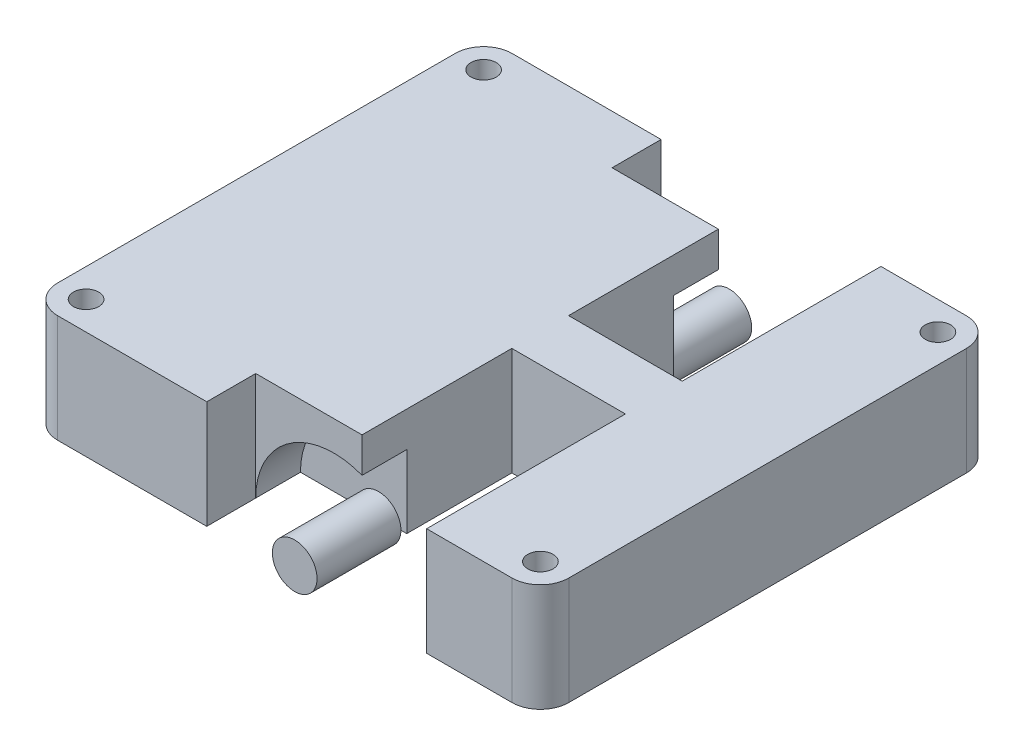
ISO-10303-21;
HEADER;
FILE_DESCRIPTION(('STEP AP214'),'2;1');
FILE_NAME('part.step','',(''),(''),'','','');
FILE_SCHEMA(('AUTOMOTIVE_DESIGN { 1 0 10303 214 1 1 1 1 }'));
ENDSEC;
DATA;
#1=APPLICATION_CONTEXT('core data for automotive mechanical design processes');
#2=APPLICATION_PROTOCOL_DEFINITION('international standard','automotive_design',2000,#1);
#3=PRODUCT_CONTEXT('',#1,'mechanical');
#4=PRODUCT('Part','Part','',(#3));
#5=PRODUCT_RELATED_PRODUCT_CATEGORY('part','',(#4));
#6=PRODUCT_DEFINITION_FORMATION('','',#4);
#7=PRODUCT_DEFINITION_CONTEXT('part definition',#1,'design');
#8=PRODUCT_DEFINITION('design','',#6,#7);
#9=PRODUCT_DEFINITION_SHAPE('','',#8);
#10=(LENGTH_UNIT() NAMED_UNIT(*) SI_UNIT(.MILLI.,.METRE.));
#11=(NAMED_UNIT(*) PLANE_ANGLE_UNIT() SI_UNIT($,.RADIAN.));
#12=(NAMED_UNIT(*) SI_UNIT($,.STERADIAN.) SOLID_ANGLE_UNIT());
#13=UNCERTAINTY_MEASURE_WITH_UNIT(LENGTH_MEASURE(1.E-05),#10,'distance_accuracy_value','');
#14=(GEOMETRIC_REPRESENTATION_CONTEXT(3) GLOBAL_UNCERTAINTY_ASSIGNED_CONTEXT((#13)) GLOBAL_UNIT_ASSIGNED_CONTEXT((#10,
#11,#12)) REPRESENTATION_CONTEXT('',''));
#15=CARTESIAN_POINT('',(0.,0.,0.));
#16=DIRECTION('',(0.,0.,1.));
#17=DIRECTION('',(1.,0.,0.));
#18=AXIS2_PLACEMENT_3D('',#15,#16,#17);
#19=CARTESIAN_POINT('',(0.,0.,11.938));
#20=DIRECTION('',(0.,0.,1.));
#21=DIRECTION('',(-1.,0.,0.));
#22=AXIS2_PLACEMENT_3D('',#19,#20,#21);
#23=PLANE('',#22);
#24=DIRECTION('',(0.,1.,0.));
#25=VECTOR('',#24,1.);
#26=CARTESIAN_POINT('',(2.52328876210815,0.,11.938));
#27=LINE('',#26,#25);
#28=CARTESIAN_POINT('',(2.52328876210815,-4.826,11.938));
#29=VERTEX_POINT('',#28);
#30=CARTESIAN_POINT('',(2.52328876210815,1.68731243093856,11.938));
#31=VERTEX_POINT('',#30);
#32=EDGE_CURVE('E11',#29,#31,#27,.T.);
#33=ORIENTED_EDGE('',*,*,#32,.T.);
#34=CARTESIAN_POINT('',(0.,-4.826,11.938));
#35=DIRECTION('',(0.,0.,-1.));
#36=DIRECTION('',(-1.,0.,0.));
#37=AXIS2_PLACEMENT_3D('',#34,#35,#36);
#38=CIRCLE('',#37,6.985);
#39=CARTESIAN_POINT('',(-6.985,-4.826,11.938));
#40=VERTEX_POINT('',#39);
#41=EDGE_CURVE('E219',#40,#31,#38,.T.);
#42=ORIENTED_EDGE('',*,*,#41,.F.);
#43=DIRECTION('',(-1.,0.,0.));
#44=VECTOR('',#43,1.);
#45=CARTESIAN_POINT('',(6.985,-4.826,11.938));
#46=LINE('',#45,#44);
#47=CARTESIAN_POINT('',(-2.,-4.826,11.938));
#48=VERTEX_POINT('',#47);
#49=EDGE_CURVE('E286',#48,#40,#46,.T.);
#50=ORIENTED_EDGE('',*,*,#49,.F.);
#51=CARTESIAN_POINT('',(0.,-4.826,11.938));
#52=DIRECTION('',(0.,0.,-1.));
#53=DIRECTION('',(-1.,0.,0.));
#54=AXIS2_PLACEMENT_3D('',#51,#52,#53);
#55=CIRCLE('',#54,2.);
#56=CARTESIAN_POINT('',(2.,-4.826,11.938));
#57=VERTEX_POINT('',#56);
#58=EDGE_CURVE('E278',#48,#57,#55,.T.);
#59=ORIENTED_EDGE('',*,*,#58,.T.);
#60=EDGE_CURVE('E282',#29,#57,#46,.T.);
#61=ORIENTED_EDGE('',*,*,#60,.F.);
#62=EDGE_LOOP('',(#33,#42,#50,#59,#61));
#63=FACE_BOUND('',#62,.T.);
#64=ADVANCED_FACE('F43',(#63),#23,.T.);
#65=CARTESIAN_POINT('',(-22.86,4.826,20.32));
#66=DIRECTION('',(0.,0.,-1.));
#67=DIRECTION('',(-1.,0.,0.));
#68=AXIS2_PLACEMENT_3D('',#65,#66,#67);
#69=PLANE('',#68);
#70=DIRECTION('',(0.,-1.,0.));
#71=VECTOR('',#70,1.);
#72=CARTESIAN_POINT('',(12.6832887621081,4.826,20.32));
#73=LINE('',#72,#71);
#74=CARTESIAN_POINT('',(12.6832887621081,4.826,20.32));
#75=VERTEX_POINT('',#74);
#76=CARTESIAN_POINT('',(12.6832887621081,-4.826,20.32));
#77=VERTEX_POINT('',#76);
#78=EDGE_CURVE('E227',#75,#77,#73,.T.);
#79=ORIENTED_EDGE('',*,*,#78,.T.);
#80=DIRECTION('',(1.,0.,0.));
#81=VECTOR('',#80,1.);
#82=CARTESIAN_POINT('',(-22.86,-4.826,20.32));
#83=LINE('',#82,#81);
#84=CARTESIAN_POINT('',(20.32,-4.826,20.32));
#85=VERTEX_POINT('',#84);
#86=EDGE_CURVE('E438',#77,#85,#83,.T.);
#87=ORIENTED_EDGE('',*,*,#86,.T.);
#88=DIRECTION('',(0.,-1.,0.));
#89=VECTOR('',#88,1.);
#90=CARTESIAN_POINT('',(20.32,4.826,20.32));
#91=LINE('',#90,#89);
#92=CARTESIAN_POINT('',(20.32,4.826,20.32));
#93=VERTEX_POINT('',#92);
#94=EDGE_CURVE('E493',#85,#93,#91,.F.);
#95=ORIENTED_EDGE('',*,*,#94,.T.);
#96=DIRECTION('',(1.,0.,0.));
#97=VECTOR('',#96,1.);
#98=CARTESIAN_POINT('',(-22.86,4.826,20.32));
#99=LINE('',#98,#97);
#100=EDGE_CURVE('E420',#75,#93,#99,.T.);
#101=ORIENTED_EDGE('',*,*,#100,.F.);
#102=EDGE_LOOP('',(#79,#87,#95,#101));
#103=FACE_BOUND('',#102,.T.);
#104=ADVANCED_FACE('F598',(#103),#69,.F.);
#105=CARTESIAN_POINT('',(0.,4.826,0.));
#106=DIRECTION('',(0.,1.,0.));
#107=DIRECTION('',(0.,0.,1.));
#108=AXIS2_PLACEMENT_3D('',#105,#106,#107);
#109=PLANE('',#108);
#110=DIRECTION('',(1.,0.,0.));
#111=VECTOR('',#110,1.);
#112=CARTESIAN_POINT('',(0.,4.826,15.938));
#113=LINE('',#112,#111);
#114=CARTESIAN_POINT('',(-6.985,4.826,15.938));
#115=VERTEX_POINT('',#114);
#116=CARTESIAN_POINT('',(2.52328876210815,4.826,15.938));
#117=VERTEX_POINT('',#116);
#118=EDGE_CURVE('E233',#115,#117,#113,.T.);
#119=ORIENTED_EDGE('',*,*,#118,.T.);
#120=DIRECTION('',(0.,0.,1.));
#121=VECTOR('',#120,1.);
#122=CARTESIAN_POINT('',(2.52328876210815,4.826,2.54000000000001));
#123=LINE('',#122,#121);
#124=CARTESIAN_POINT('',(2.52328876210815,4.826,2.54000000000001));
#125=VERTEX_POINT('',#124);
#126=EDGE_CURVE('E231',#125,#117,#123,.T.);
#127=ORIENTED_EDGE('',*,*,#126,.F.);
#128=DIRECTION('',(1.,0.,0.));
#129=VECTOR('',#128,1.);
#130=CARTESIAN_POINT('',(2.52328876210815,4.826,2.54000000000001));
#131=LINE('',#130,#129);
#132=CARTESIAN_POINT('',(12.6832887621081,4.826,2.54000000000001));
#133=VERTEX_POINT('',#132);
#134=EDGE_CURVE('E242',#125,#133,#131,.T.);
#135=ORIENTED_EDGE('',*,*,#134,.T.);
#136=DIRECTION('',(0.,0.,1.));
#137=VECTOR('',#136,1.);
#138=CARTESIAN_POINT('',(12.6832887621081,4.826,2.54000000000001));
#139=LINE('',#138,#137);
#140=EDGE_CURVE('E259',#133,#75,#139,.T.);
#141=ORIENTED_EDGE('',*,*,#140,.T.);
#142=ORIENTED_EDGE('',*,*,#100,.T.);
#143=CARTESIAN_POINT('',(20.32,4.826,17.78));
#144=DIRECTION('',(0.,1.,0.));
#145=DIRECTION('',(0.,0.,1.));
#146=AXIS2_PLACEMENT_3D('',#143,#144,#145);
#147=CIRCLE('',#146,2.54);
#148=CARTESIAN_POINT('',(22.86,4.826,17.78));
#149=VERTEX_POINT('',#148);
#150=EDGE_CURVE('E473',#93,#149,#147,.T.);
#151=ORIENTED_EDGE('',*,*,#150,.T.);
#152=DIRECTION('',(0.,0.,-1.));
#153=VECTOR('',#152,1.);
#154=CARTESIAN_POINT('',(22.86,4.826,-20.32));
#155=LINE('',#154,#153);
#156=CARTESIAN_POINT('',(22.86,4.826,-17.78));
#157=VERTEX_POINT('',#156);
#158=EDGE_CURVE('E406',#149,#157,#155,.T.);
#159=ORIENTED_EDGE('',*,*,#158,.T.);
#160=CARTESIAN_POINT('',(20.32,4.826,-17.78));
#161=DIRECTION('',(0.,1.,0.));
#162=DIRECTION('',(0.,0.,1.));
#163=AXIS2_PLACEMENT_3D('',#160,#161,#162);
#164=CIRCLE('',#163,2.54);
#165=CARTESIAN_POINT('',(20.32,4.826,-20.32));
#166=VERTEX_POINT('',#165);
#167=EDGE_CURVE('E479',#157,#166,#164,.T.);
#168=ORIENTED_EDGE('',*,*,#167,.T.);
#169=DIRECTION('',(-1.,0.,0.));
#170=VECTOR('',#169,1.);
#171=CARTESIAN_POINT('',(-22.86,4.826,-20.32));
#172=LINE('',#171,#170);
#173=CARTESIAN_POINT('',(12.6832887621081,4.826,-20.32));
#174=VERTEX_POINT('',#173);
#175=EDGE_CURVE('E412',#166,#174,#172,.T.);
#176=ORIENTED_EDGE('',*,*,#175,.T.);
#177=DIRECTION('',(0.,0.,-1.));
#178=VECTOR('',#177,1.);
#179=CARTESIAN_POINT('',(12.6832887621081,4.826,-2.54000000000001));
#180=LINE('',#179,#178);
#181=CARTESIAN_POINT('',(12.6832887621081,4.826,-2.54000000000001));
#182=VERTEX_POINT('',#181);
#183=EDGE_CURVE('E333',#182,#174,#180,.T.);
#184=ORIENTED_EDGE('',*,*,#183,.F.);
#185=DIRECTION('',(1.,0.,0.));
#186=VECTOR('',#185,1.);
#187=CARTESIAN_POINT('',(2.52328876210815,4.826,-2.54000000000001));
#188=LINE('',#187,#186);
#189=CARTESIAN_POINT('',(2.52328876210815,4.826,-2.54000000000001));
#190=VERTEX_POINT('',#189);
#191=EDGE_CURVE('E318',#190,#182,#188,.T.);
#192=ORIENTED_EDGE('',*,*,#191,.F.);
#193=DIRECTION('',(0.,0.,-1.));
#194=VECTOR('',#193,1.);
#195=CARTESIAN_POINT('',(2.52328876210815,4.826,-2.54000000000001));
#196=LINE('',#195,#194);
#197=CARTESIAN_POINT('',(2.52328876210815,4.826,-15.938));
#198=VERTEX_POINT('',#197);
#199=EDGE_CURVE('E336',#190,#198,#196,.T.);
#200=ORIENTED_EDGE('',*,*,#199,.T.);
#201=DIRECTION('',(1.,0.,0.));
#202=VECTOR('',#201,1.);
#203=CARTESIAN_POINT('',(0.,4.826,-15.938));
#204=LINE('',#203,#202);
#205=CARTESIAN_POINT('',(-6.985,4.826,-15.938));
#206=VERTEX_POINT('',#205);
#207=EDGE_CURVE('E304',#206,#198,#204,.T.);
#208=ORIENTED_EDGE('',*,*,#207,.F.);
#209=DIRECTION('',(0.,0.,-1.));
#210=VECTOR('',#209,1.);
#211=CARTESIAN_POINT('',(-6.985,4.826,-11.938));
#212=LINE('',#211,#210);
#213=CARTESIAN_POINT('',(-6.985,4.826,-20.32));
#214=VERTEX_POINT('',#213);
#215=EDGE_CURVE('E361',#206,#214,#212,.T.);
#216=ORIENTED_EDGE('',*,*,#215,.T.);
#217=CARTESIAN_POINT('',(-20.32,4.826,-20.32));
#218=VERTEX_POINT('',#217);
#219=EDGE_CURVE('E410',#214,#218,#172,.T.);
#220=ORIENTED_EDGE('',*,*,#219,.T.);
#221=CARTESIAN_POINT('',(-20.32,4.826,-17.78));
#222=DIRECTION('',(0.,1.,0.));
#223=DIRECTION('',(0.,0.,1.));
#224=AXIS2_PLACEMENT_3D('',#221,#222,#223);
#225=CIRCLE('',#224,2.54);
#226=CARTESIAN_POINT('',(-22.86,4.826,-17.78));
#227=VERTEX_POINT('',#226);
#228=EDGE_CURVE('E476',#218,#227,#225,.T.);
#229=ORIENTED_EDGE('',*,*,#228,.T.);
#230=DIRECTION('',(0.,0.,1.));
#231=VECTOR('',#230,1.);
#232=CARTESIAN_POINT('',(-22.86,4.826,-20.32));
#233=LINE('',#232,#231);
#234=CARTESIAN_POINT('',(-22.86,4.826,17.78));
#235=VERTEX_POINT('',#234);
#236=EDGE_CURVE('E416',#227,#235,#233,.T.);
#237=ORIENTED_EDGE('',*,*,#236,.T.);
#238=CARTESIAN_POINT('',(-20.32,4.826,17.78));
#239=DIRECTION('',(0.,1.,0.));
#240=DIRECTION('',(0.,0.,1.));
#241=AXIS2_PLACEMENT_3D('',#238,#239,#240);
#242=CIRCLE('',#241,2.54);
#243=CARTESIAN_POINT('',(-20.32,4.826,20.32));
#244=VERTEX_POINT('',#243);
#245=EDGE_CURVE('E470',#235,#244,#242,.T.);
#246=ORIENTED_EDGE('',*,*,#245,.T.);
#247=CARTESIAN_POINT('',(-6.985,4.826,20.32));
#248=VERTEX_POINT('',#247);
#249=EDGE_CURVE('E421',#244,#248,#99,.T.);
#250=ORIENTED_EDGE('',*,*,#249,.T.);
#251=DIRECTION('',(0.,0.,1.));
#252=VECTOR('',#251,1.);
#253=CARTESIAN_POINT('',(-6.985,4.826,11.938));
#254=LINE('',#253,#252);
#255=EDGE_CURVE('E290',#115,#248,#254,.T.);
#256=ORIENTED_EDGE('',*,*,#255,.F.);
#257=EDGE_LOOP('',(#119,#127,#135,#141,#142,#151,#159,#168,#176,#184,#192,#200,#208,#216,#220,
#229,#237,#246,#250,#256));
#258=FACE_BOUND('',#257,.T.);
#259=CARTESIAN_POINT('',(20.32,4.826,-17.78));
#260=DIRECTION('',(0.,1.,0.));
#261=DIRECTION('',(0.,0.,1.));
#262=AXIS2_PLACEMENT_3D('',#259,#260,#261);
#263=CIRCLE('',#262,1.13029999999999);
#264=CARTESIAN_POINT('',(20.32,4.826,-16.6497));
#265=VERTEX_POINT('',#264);
#266=EDGE_CURVE('E370',#265,#265,#263,.T.);
#267=ORIENTED_EDGE('',*,*,#266,.F.);
#268=EDGE_LOOP('',(#267));
#269=FACE_BOUND('',#268,.T.);
#270=CARTESIAN_POINT('',(-20.32,4.826,17.78));
#271=DIRECTION('',(0.,1.,0.));
#272=DIRECTION('',(0.,0.,1.));
#273=AXIS2_PLACEMENT_3D('',#270,#271,#272);
#274=CIRCLE('',#273,1.13029999999999);
#275=CARTESIAN_POINT('',(-20.32,4.826,18.9103));
#276=VERTEX_POINT('',#275);
#277=EDGE_CURVE('E381',#276,#276,#274,.T.);
#278=ORIENTED_EDGE('',*,*,#277,.F.);
#279=EDGE_LOOP('',(#278));
#280=FACE_BOUND('',#279,.T.);
#281=CARTESIAN_POINT('',(-20.32,4.826,-17.78));
#282=DIRECTION('',(0.,1.,0.));
#283=DIRECTION('',(0.,0.,1.));
#284=AXIS2_PLACEMENT_3D('',#281,#282,#283);
#285=CIRCLE('',#284,1.13029999999999);
#286=CARTESIAN_POINT('',(-20.32,4.826,-16.6497));
#287=VERTEX_POINT('',#286);
#288=EDGE_CURVE('E389',#287,#287,#285,.T.);
#289=ORIENTED_EDGE('',*,*,#288,.F.);
#290=EDGE_LOOP('',(#289));
#291=FACE_BOUND('',#290,.T.);
#292=CARTESIAN_POINT('',(20.32,4.826,17.78));
#293=DIRECTION('',(0.,1.,0.));
#294=DIRECTION('',(0.,0.,1.));
#295=AXIS2_PLACEMENT_3D('',#292,#293,#294);
#296=CIRCLE('',#295,1.13029999999999);
#297=CARTESIAN_POINT('',(20.32,4.826,18.9103));
#298=VERTEX_POINT('',#297);
#299=EDGE_CURVE('E397',#298,#298,#296,.T.);
#300=ORIENTED_EDGE('',*,*,#299,.F.);
#301=EDGE_LOOP('',(#300));
#302=FACE_BOUND('',#301,.T.);
#303=ADVANCED_FACE('F537',(#258,#269,#280,#291,#302),#109,.T.);
#304=CARTESIAN_POINT('',(0.,-4.826,0.));
#305=DIRECTION('',(0.,1.,0.));
#306=DIRECTION('',(0.,0.,1.));
#307=AXIS2_PLACEMENT_3D('',#304,#305,#306);
#308=PLANE('',#307);
#309=CARTESIAN_POINT('',(20.32,-4.82599999999999,-17.78));
#310=DIRECTION('',(0.,1.,0.));
#311=DIRECTION('',(0.,0.,1.));
#312=AXIS2_PLACEMENT_3D('',#309,#310,#311);
#313=CIRCLE('',#312,1.13029999999999);
#314=CARTESIAN_POINT('',(20.32,-4.82599999999999,-16.6497));
#315=VERTEX_POINT('',#314);
#316=EDGE_CURVE('E377',#315,#315,#313,.T.);
#317=ORIENTED_EDGE('',*,*,#316,.T.);
#318=EDGE_LOOP('',(#317));
#319=FACE_BOUND('',#318,.T.);
#320=CARTESIAN_POINT('',(-20.32,-4.82599999999999,17.78));
#321=DIRECTION('',(0.,1.,0.));
#322=DIRECTION('',(0.,0.,1.));
#323=AXIS2_PLACEMENT_3D('',#320,#321,#322);
#324=CIRCLE('',#323,1.13029999999999);
#325=CARTESIAN_POINT('',(-20.32,-4.82599999999999,18.9103));
#326=VERTEX_POINT('',#325);
#327=EDGE_CURVE('E385',#326,#326,#324,.T.);
#328=ORIENTED_EDGE('',*,*,#327,.T.);
#329=EDGE_LOOP('',(#328));
#330=FACE_BOUND('',#329,.T.);
#331=CARTESIAN_POINT('',(-20.32,-4.82599999999999,-17.78));
#332=DIRECTION('',(0.,1.,0.));
#333=DIRECTION('',(0.,0.,1.));
#334=AXIS2_PLACEMENT_3D('',#331,#332,#333);
#335=CIRCLE('',#334,1.13029999999999);
#336=CARTESIAN_POINT('',(-20.32,-4.82599999999999,-16.6497));
#337=VERTEX_POINT('',#336);
#338=EDGE_CURVE('E393',#337,#337,#335,.T.);
#339=ORIENTED_EDGE('',*,*,#338,.T.);
#340=EDGE_LOOP('',(#339));
#341=FACE_BOUND('',#340,.T.);
#342=CARTESIAN_POINT('',(20.32,-4.82599999999999,17.78));
#343=DIRECTION('',(0.,1.,0.));
#344=DIRECTION('',(0.,0.,1.));
#345=AXIS2_PLACEMENT_3D('',#342,#343,#344);
#346=CIRCLE('',#345,1.13029999999999);
#347=CARTESIAN_POINT('',(20.32,-4.82599999999999,18.9103));
#348=VERTEX_POINT('',#347);
#349=EDGE_CURVE('E401',#348,#348,#346,.T.);
#350=ORIENTED_EDGE('',*,*,#349,.T.);
#351=EDGE_LOOP('',(#350));
#352=FACE_BOUND('',#351,.T.);
#353=DIRECTION('',(0.,0.,1.));
#354=VECTOR('',#353,1.);
#355=CARTESIAN_POINT('',(12.6832887621081,-4.826,2.54000000000001));
#356=LINE('',#355,#354);
#357=CARTESIAN_POINT('',(12.6832887621081,-4.826,2.54000000000001));
#358=VERTEX_POINT('',#357);
#359=EDGE_CURVE('E264',#358,#77,#356,.T.);
#360=ORIENTED_EDGE('',*,*,#359,.F.);
#361=DIRECTION('',(-1.,0.,0.));
#362=VECTOR('',#361,1.);
#363=CARTESIAN_POINT('',(12.6832887621081,-4.826,2.54000000000001));
#364=LINE('',#363,#362);
#365=CARTESIAN_POINT('',(2.52328876210815,-4.826,2.54000000000001));
#366=VERTEX_POINT('',#365);
#367=EDGE_CURVE('E249',#358,#366,#364,.T.);
#368=ORIENTED_EDGE('',*,*,#367,.T.);
#369=DIRECTION('',(0.,0.,1.));
#370=VECTOR('',#369,1.);
#371=CARTESIAN_POINT('',(2.52328876210815,-4.826,2.54000000000001));
#372=LINE('',#371,#370);
#373=EDGE_CURVE('E267',#366,#29,#372,.T.);
#374=ORIENTED_EDGE('',*,*,#373,.T.);
#375=ORIENTED_EDGE('',*,*,#60,.T.);
#376=EDGE_CURVE('E285',#57,#48,#46,.T.);
#377=ORIENTED_EDGE('',*,*,#376,.T.);
#378=ORIENTED_EDGE('',*,*,#49,.T.);
#379=DIRECTION('',(0.,0.,1.));
#380=VECTOR('',#379,1.);
#381=CARTESIAN_POINT('',(-6.985,-4.826,11.938));
#382=LINE('',#381,#380);
#383=CARTESIAN_POINT('',(-6.985,-4.826,15.938));
#384=VERTEX_POINT('',#383);
#385=EDGE_CURVE('E294',#40,#384,#382,.T.);
#386=ORIENTED_EDGE('',*,*,#385,.T.);
#387=CARTESIAN_POINT('',(-6.985,-4.826,20.32));
#388=VERTEX_POINT('',#387);
#389=EDGE_CURVE('E64',#384,#388,#382,.T.);
#390=ORIENTED_EDGE('',*,*,#389,.T.);
#391=CARTESIAN_POINT('',(-20.32,-4.826,20.32));
#392=VERTEX_POINT('',#391);
#393=EDGE_CURVE('E411',#392,#388,#83,.T.);
#394=ORIENTED_EDGE('',*,*,#393,.F.);
#395=CARTESIAN_POINT('',(-20.32,-4.826,17.78));
#396=DIRECTION('',(0.,1.,0.));
#397=DIRECTION('',(0.,0.,1.));
#398=AXIS2_PLACEMENT_3D('',#395,#396,#397);
#399=CIRCLE('',#398,2.54);
#400=CARTESIAN_POINT('',(-22.86,-4.826,17.78));
#401=VERTEX_POINT('',#400);
#402=EDGE_CURVE('E449',#392,#401,#399,.F.);
#403=ORIENTED_EDGE('',*,*,#402,.T.);
#404=DIRECTION('',(0.,0.,1.));
#405=VECTOR('',#404,1.);
#406=CARTESIAN_POINT('',(-22.86,-4.826,-20.32));
#407=LINE('',#406,#405);
#408=CARTESIAN_POINT('',(-22.86,-4.826,-17.78));
#409=VERTEX_POINT('',#408);
#410=EDGE_CURVE('E434',#409,#401,#407,.T.);
#411=ORIENTED_EDGE('',*,*,#410,.F.);
#412=CARTESIAN_POINT('',(-20.32,-4.826,-17.78));
#413=DIRECTION('',(0.,1.,0.));
#414=DIRECTION('',(0.,0.,1.));
#415=AXIS2_PLACEMENT_3D('',#412,#413,#414);
#416=CIRCLE('',#415,2.54);
#417=CARTESIAN_POINT('',(-20.32,-4.826,-20.32));
#418=VERTEX_POINT('',#417);
#419=EDGE_CURVE('E456',#409,#418,#416,.F.);
#420=ORIENTED_EDGE('',*,*,#419,.T.);
#421=DIRECTION('',(-1.,0.,0.));
#422=VECTOR('',#421,1.);
#423=CARTESIAN_POINT('',(-22.86,-4.826,-20.32));
#424=LINE('',#423,#422);
#425=CARTESIAN_POINT('',(-6.985,-4.826,-20.32));
#426=VERTEX_POINT('',#425);
#427=EDGE_CURVE('E429',#426,#418,#424,.T.);
#428=ORIENTED_EDGE('',*,*,#427,.F.);
#429=DIRECTION('',(0.,0.,-1.));
#430=VECTOR('',#429,1.);
#431=CARTESIAN_POINT('',(-6.985,-4.826,-11.938));
#432=LINE('',#431,#430);
#433=CARTESIAN_POINT('',(-6.985,-4.826,-15.938));
#434=VERTEX_POINT('',#433);
#435=EDGE_CURVE('E371',#434,#426,#432,.T.);
#436=ORIENTED_EDGE('',*,*,#435,.F.);
#437=CARTESIAN_POINT('',(-6.985,-4.826,-11.938));
#438=VERTEX_POINT('',#437);
#439=EDGE_CURVE('E367',#438,#434,#432,.T.);
#440=ORIENTED_EDGE('',*,*,#439,.F.);
#441=DIRECTION('',(-1.,0.,0.));
#442=VECTOR('',#441,1.);
#443=CARTESIAN_POINT('',(6.985,-4.826,-11.938));
#444=LINE('',#443,#442);
#445=CARTESIAN_POINT('',(-2.,-4.826,-11.938));
#446=VERTEX_POINT('',#445);
#447=EDGE_CURVE('E363',#446,#438,#444,.T.);
#448=ORIENTED_EDGE('',*,*,#447,.F.);
#449=CARTESIAN_POINT('',(2.,-4.826,-11.938));
#450=VERTEX_POINT('',#449);
#451=EDGE_CURVE('E362',#450,#446,#444,.T.);
#452=ORIENTED_EDGE('',*,*,#451,.F.);
#453=CARTESIAN_POINT('',(2.52328876210815,-4.826,-11.938));
#454=VERTEX_POINT('',#453);
#455=EDGE_CURVE('E358',#454,#450,#444,.T.);
#456=ORIENTED_EDGE('',*,*,#455,.F.);
#457=DIRECTION('',(0.,0.,-1.));
#458=VECTOR('',#457,1.);
#459=CARTESIAN_POINT('',(2.52328876210815,-4.826,-2.54000000000001));
#460=LINE('',#459,#458);
#461=CARTESIAN_POINT('',(2.52328876210815,-4.826,-2.54000000000001));
#462=VERTEX_POINT('',#461);
#463=EDGE_CURVE('E340',#462,#454,#460,.T.);
#464=ORIENTED_EDGE('',*,*,#463,.F.);
#465=DIRECTION('',(-1.,0.,0.));
#466=VECTOR('',#465,1.);
#467=CARTESIAN_POINT('',(12.6832887621081,-4.826,-2.54000000000001));
#468=LINE('',#467,#466);
#469=CARTESIAN_POINT('',(12.6832887621081,-4.826,-2.54000000000001));
#470=VERTEX_POINT('',#469);
#471=EDGE_CURVE('E326',#470,#462,#468,.T.);
#472=ORIENTED_EDGE('',*,*,#471,.F.);
#473=DIRECTION('',(0.,0.,-1.));
#474=VECTOR('',#473,1.);
#475=CARTESIAN_POINT('',(12.6832887621081,-4.826,-2.54000000000001));
#476=LINE('',#475,#474);
#477=CARTESIAN_POINT('',(12.6832887621081,-4.826,-20.32));
#478=VERTEX_POINT('',#477);
#479=EDGE_CURVE('E343',#470,#478,#476,.T.);
#480=ORIENTED_EDGE('',*,*,#479,.T.);
#481=CARTESIAN_POINT('',(20.32,-4.826,-20.32));
#482=VERTEX_POINT('',#481);
#483=EDGE_CURVE('E430',#482,#478,#424,.T.);
#484=ORIENTED_EDGE('',*,*,#483,.F.);
#485=CARTESIAN_POINT('',(20.32,-4.826,-17.78));
#486=DIRECTION('',(0.,1.,0.));
#487=DIRECTION('',(0.,0.,1.));
#488=AXIS2_PLACEMENT_3D('',#485,#486,#487);
#489=CIRCLE('',#488,2.54);
#490=CARTESIAN_POINT('',(22.86,-4.826,-17.78));
#491=VERTEX_POINT('',#490);
#492=EDGE_CURVE('E460',#482,#491,#489,.F.);
#493=ORIENTED_EDGE('',*,*,#492,.T.);
#494=DIRECTION('',(0.,0.,-1.));
#495=VECTOR('',#494,1.);
#496=CARTESIAN_POINT('',(22.86,-4.826,-20.32));
#497=LINE('',#496,#495);
#498=CARTESIAN_POINT('',(22.86,-4.826,17.78));
#499=VERTEX_POINT('',#498);
#500=EDGE_CURVE('E405',#499,#491,#497,.T.);
#501=ORIENTED_EDGE('',*,*,#500,.F.);
#502=CARTESIAN_POINT('',(20.32,-4.826,17.78));
#503=DIRECTION('',(0.,1.,0.));
#504=DIRECTION('',(0.,0.,1.));
#505=AXIS2_PLACEMENT_3D('',#502,#503,#504);
#506=CIRCLE('',#505,2.54);
#507=EDGE_CURVE('E452',#499,#85,#506,.F.);
#508=ORIENTED_EDGE('',*,*,#507,.T.);
#509=ORIENTED_EDGE('',*,*,#86,.F.);
#510=EDGE_LOOP('',(#360,#368,#374,#375,#377,#378,#386,#390,#394,#403,#411,#420,#428,#436,#440,
#448,#452,#456,#464,#472,#480,#484,#493,#501,#508,#509));
#511=FACE_BOUND('',#510,.T.);
#512=ADVANCED_FACE('F514',(#319,#330,#341,#352,#511),#308,.F.);
#513=DIRECTION('',(0.,1.,0.));
#514=VECTOR('',#513,1.);
#515=CARTESIAN_POINT('',(-6.985,4.826,20.32));
#516=LINE('',#515,#514);
#517=EDGE_CURVE('E277',#388,#248,#516,.T.);
#518=ORIENTED_EDGE('',*,*,#517,.T.);
#519=ORIENTED_EDGE('',*,*,#249,.F.);
#520=DIRECTION('',(0.,-1.,0.));
#521=VECTOR('',#520,1.);
#522=CARTESIAN_POINT('',(-20.32,4.826,20.32));
#523=LINE('',#522,#521);
#524=EDGE_CURVE('E489',#244,#392,#523,.T.);
#525=ORIENTED_EDGE('',*,*,#524,.T.);
#526=ORIENTED_EDGE('',*,*,#393,.T.);
#527=EDGE_LOOP('',(#518,#519,#525,#526));
#528=FACE_BOUND('',#527,.T.);
#529=ADVANCED_FACE('F586',(#528),#69,.F.);
#530=CARTESIAN_POINT('',(-22.86,4.826,-20.32));
#531=DIRECTION('',(0.,0.,1.));
#532=DIRECTION('',(1.,0.,0.));
#533=AXIS2_PLACEMENT_3D('',#530,#531,#532);
#534=PLANE('',#533);
#535=ORIENTED_EDGE('',*,*,#219,.F.);
#536=DIRECTION('',(0.,1.,0.));
#537=VECTOR('',#536,1.);
#538=CARTESIAN_POINT('',(-6.985,4.826,-20.32));
#539=LINE('',#538,#537);
#540=EDGE_CURVE('E353',#426,#214,#539,.T.);
#541=ORIENTED_EDGE('',*,*,#540,.F.);
#542=ORIENTED_EDGE('',*,*,#427,.T.);
#543=DIRECTION('',(0.,-1.,0.));
#544=VECTOR('',#543,1.);
#545=CARTESIAN_POINT('',(-20.32,4.826,-20.32));
#546=LINE('',#545,#544);
#547=EDGE_CURVE('E425',#418,#218,#546,.F.);
#548=ORIENTED_EDGE('',*,*,#547,.T.);
#549=EDGE_LOOP('',(#535,#541,#542,#548));
#550=FACE_BOUND('',#549,.T.);
#551=ADVANCED_FACE('F570',(#550),#534,.F.);
#552=CARTESIAN_POINT('',(22.86,4.826,-20.32));
#553=DIRECTION('',(-1.,0.,0.));
#554=DIRECTION('',(0.,0.,1.));
#555=AXIS2_PLACEMENT_3D('',#552,#553,#554);
#556=PLANE('',#555);
#557=ORIENTED_EDGE('',*,*,#500,.T.);
#558=DIRECTION('',(0.,-1.,0.));
#559=VECTOR('',#558,1.);
#560=CARTESIAN_POINT('',(22.86,4.826,-17.78));
#561=LINE('',#560,#559);
#562=EDGE_CURVE('E467',#491,#157,#561,.F.);
#563=ORIENTED_EDGE('',*,*,#562,.T.);
#564=ORIENTED_EDGE('',*,*,#158,.F.);
#565=DIRECTION('',(0.,-1.,0.));
#566=VECTOR('',#565,1.);
#567=CARTESIAN_POINT('',(22.86,4.826,17.78));
#568=LINE('',#567,#566);
#569=EDGE_CURVE('E463',#149,#499,#568,.T.);
#570=ORIENTED_EDGE('',*,*,#569,.T.);
#571=EDGE_LOOP('',(#557,#563,#564,#570));
#572=FACE_BOUND('',#571,.T.);
#573=ADVANCED_FACE('F555',(#572),#556,.F.);
#574=ORIENTED_EDGE('',*,*,#483,.T.);
#575=DIRECTION('',(0.,-1.,0.));
#576=VECTOR('',#575,1.);
#577=CARTESIAN_POINT('',(12.6832887621081,4.826,-20.32));
#578=LINE('',#577,#576);
#579=EDGE_CURVE('E317',#174,#478,#578,.T.);
#580=ORIENTED_EDGE('',*,*,#579,.F.);
#581=ORIENTED_EDGE('',*,*,#175,.F.);
#582=DIRECTION('',(0.,-1.,0.));
#583=VECTOR('',#582,1.);
#584=CARTESIAN_POINT('',(20.32,4.826,-20.32));
#585=LINE('',#584,#583);
#586=EDGE_CURVE('E445',#166,#482,#585,.T.);
#587=ORIENTED_EDGE('',*,*,#586,.T.);
#588=EDGE_LOOP('',(#574,#580,#581,#587));
#589=FACE_BOUND('',#588,.T.);
#590=ADVANCED_FACE('F548',(#589),#534,.F.);
#591=CARTESIAN_POINT('',(-22.86,4.826,-20.32));
#592=DIRECTION('',(1.,0.,0.));
#593=DIRECTION('',(0.,0.,-1.));
#594=AXIS2_PLACEMENT_3D('',#591,#592,#593);
#595=PLANE('',#594);
#596=ORIENTED_EDGE('',*,*,#236,.F.);
#597=DIRECTION('',(0.,-1.,0.));
#598=VECTOR('',#597,1.);
#599=CARTESIAN_POINT('',(-22.86,4.826,-17.78));
#600=LINE('',#599,#598);
#601=EDGE_CURVE('E485',#227,#409,#600,.T.);
#602=ORIENTED_EDGE('',*,*,#601,.T.);
#603=ORIENTED_EDGE('',*,*,#410,.T.);
#604=DIRECTION('',(0.,-1.,0.));
#605=VECTOR('',#604,1.);
#606=CARTESIAN_POINT('',(-22.86,4.826,17.78));
#607=LINE('',#606,#605);
#608=EDGE_CURVE('E482',#401,#235,#607,.F.);
#609=ORIENTED_EDGE('',*,*,#608,.T.);
#610=EDGE_LOOP('',(#596,#602,#603,#609));
#611=FACE_BOUND('',#610,.T.);
#612=ADVANCED_FACE('F580',(#611),#595,.F.);
#613=CARTESIAN_POINT('',(20.32,4.826,-17.78));
#614=DIRECTION('',(0.,-1.,0.));
#615=DIRECTION('',(0.,0.,-1.));
#616=AXIS2_PLACEMENT_3D('',#613,#614,#615);
#617=CYLINDRICAL_SURFACE('',#616,2.54);
#618=ORIENTED_EDGE('',*,*,#167,.F.);
#619=ORIENTED_EDGE('',*,*,#562,.F.);
#620=ORIENTED_EDGE('',*,*,#492,.F.);
#621=ORIENTED_EDGE('',*,*,#586,.F.);
#622=EDGE_LOOP('',(#618,#619,#620,#621));
#623=FACE_BOUND('',#622,.T.);
#624=ADVANCED_FACE('F559',(#623),#617,.T.);
#625=CARTESIAN_POINT('',(-20.32,4.826,-17.78));
#626=DIRECTION('',(0.,-1.,0.));
#627=DIRECTION('',(0.,0.,-1.));
#628=AXIS2_PLACEMENT_3D('',#625,#626,#627);
#629=CYLINDRICAL_SURFACE('',#628,2.54);
#630=ORIENTED_EDGE('',*,*,#228,.F.);
#631=ORIENTED_EDGE('',*,*,#547,.F.);
#632=ORIENTED_EDGE('',*,*,#419,.F.);
#633=ORIENTED_EDGE('',*,*,#601,.F.);
#634=EDGE_LOOP('',(#630,#631,#632,#633));
#635=FACE_BOUND('',#634,.T.);
#636=ADVANCED_FACE('F576',(#635),#629,.T.);
#637=CARTESIAN_POINT('',(20.32,4.826,17.78));
#638=DIRECTION('',(0.,-1.,0.));
#639=DIRECTION('',(0.,0.,-1.));
#640=AXIS2_PLACEMENT_3D('',#637,#638,#639);
#641=CYLINDRICAL_SURFACE('',#640,2.54);
#642=ORIENTED_EDGE('',*,*,#150,.F.);
#643=ORIENTED_EDGE('',*,*,#94,.F.);
#644=ORIENTED_EDGE('',*,*,#507,.F.);
#645=ORIENTED_EDGE('',*,*,#569,.F.);
#646=EDGE_LOOP('',(#642,#643,#644,#645));
#647=FACE_BOUND('',#646,.T.);
#648=ADVANCED_FACE('F562',(#647),#641,.T.);
#649=CARTESIAN_POINT('',(-20.32,4.826,17.78));
#650=DIRECTION('',(0.,-1.,0.));
#651=DIRECTION('',(0.,0.,-1.));
#652=AXIS2_PLACEMENT_3D('',#649,#650,#651);
#653=CYLINDRICAL_SURFACE('',#652,2.54);
#654=ORIENTED_EDGE('',*,*,#245,.F.);
#655=ORIENTED_EDGE('',*,*,#608,.F.);
#656=ORIENTED_EDGE('',*,*,#402,.F.);
#657=ORIENTED_EDGE('',*,*,#524,.F.);
#658=EDGE_LOOP('',(#654,#655,#656,#657));
#659=FACE_BOUND('',#658,.T.);
#660=ADVANCED_FACE('F45',(#659),#653,.T.);
#661=CARTESIAN_POINT('',(20.32,4.826,17.78));
#662=DIRECTION('',(0.,1.,0.));
#663=DIRECTION('',(0.,0.,1.));
#664=AXIS2_PLACEMENT_3D('',#661,#662,#663);
#665=CYLINDRICAL_SURFACE('',#664,1.13029999999999);
#666=ORIENTED_EDGE('',*,*,#349,.F.);
#667=EDGE_LOOP('',(#666));
#668=FACE_BOUND('',#667,.T.);
#669=ORIENTED_EDGE('',*,*,#299,.T.);
#670=EDGE_LOOP('',(#669));
#671=FACE_BOUND('',#670,.T.);
#672=ADVANCED_FACE('F623',(#668,#671),#665,.F.);
#673=CARTESIAN_POINT('',(-20.32,4.826,-17.78));
#674=DIRECTION('',(0.,1.,0.));
#675=DIRECTION('',(0.,0.,1.));
#676=AXIS2_PLACEMENT_3D('',#673,#674,#675);
#677=CYLINDRICAL_SURFACE('',#676,1.13029999999999);
#678=ORIENTED_EDGE('',*,*,#338,.F.);
#679=EDGE_LOOP('',(#678));
#680=FACE_BOUND('',#679,.T.);
#681=ORIENTED_EDGE('',*,*,#288,.T.);
#682=EDGE_LOOP('',(#681));
#683=FACE_BOUND('',#682,.T.);
#684=ADVANCED_FACE('F626',(#680,#683),#677,.F.);
#685=CARTESIAN_POINT('',(-20.32,4.826,17.78));
#686=DIRECTION('',(0.,1.,0.));
#687=DIRECTION('',(0.,0.,1.));
#688=AXIS2_PLACEMENT_3D('',#685,#686,#687);
#689=CYLINDRICAL_SURFACE('',#688,1.13029999999999);
#690=ORIENTED_EDGE('',*,*,#327,.F.);
#691=EDGE_LOOP('',(#690));
#692=FACE_BOUND('',#691,.T.);
#693=ORIENTED_EDGE('',*,*,#277,.T.);
#694=EDGE_LOOP('',(#693));
#695=FACE_BOUND('',#694,.T.);
#696=ADVANCED_FACE('F630',(#692,#695),#689,.F.);
#697=CARTESIAN_POINT('',(20.32,4.826,-17.78));
#698=DIRECTION('',(0.,1.,0.));
#699=DIRECTION('',(0.,0.,1.));
#700=AXIS2_PLACEMENT_3D('',#697,#698,#699);
#701=CYLINDRICAL_SURFACE('',#700,1.13029999999999);
#702=ORIENTED_EDGE('',*,*,#316,.F.);
#703=EDGE_LOOP('',(#702));
#704=FACE_BOUND('',#703,.T.);
#705=ORIENTED_EDGE('',*,*,#266,.T.);
#706=EDGE_LOOP('',(#705));
#707=FACE_BOUND('',#706,.T.);
#708=ADVANCED_FACE('F634',(#704,#707),#701,.F.);
#709=CARTESIAN_POINT('',(-6.985,4.826,-11.938));
#710=DIRECTION('',(-1.,0.,0.));
#711=DIRECTION('',(0.,0.,1.));
#712=AXIS2_PLACEMENT_3D('',#709,#710,#711);
#713=PLANE('',#712);
#714=ORIENTED_EDGE('',*,*,#215,.F.);
#715=DIRECTION('',(0.,1.,0.));
#716=VECTOR('',#715,1.);
#717=CARTESIAN_POINT('',(-6.985,0.,-15.938));
#718=LINE('',#717,#716);
#719=EDGE_CURVE('E301',#434,#206,#718,.T.);
#720=ORIENTED_EDGE('',*,*,#719,.F.);
#721=ORIENTED_EDGE('',*,*,#435,.T.);
#722=ORIENTED_EDGE('',*,*,#540,.T.);
#723=EDGE_LOOP('',(#714,#720,#721,#722));
#724=FACE_BOUND('',#723,.T.);
#725=ADVANCED_FACE('F533',(#724),#713,.F.);
#726=CARTESIAN_POINT('',(0.,0.,-11.938));
#727=DIRECTION('',(0.,0.,-1.));
#728=DIRECTION('',(-1.,0.,0.));
#729=AXIS2_PLACEMENT_3D('',#726,#727,#728);
#730=PLANE('',#729);
#731=CARTESIAN_POINT('',(0.,-4.826,-11.938));
#732=DIRECTION('',(0.,0.,-1.));
#733=DIRECTION('',(-1.,0.,0.));
#734=AXIS2_PLACEMENT_3D('',#731,#732,#733);
#735=CIRCLE('',#734,6.985);
#736=CARTESIAN_POINT('',(2.52328876210815,1.68731243093856,-11.938));
#737=VERTEX_POINT('',#736);
#738=EDGE_CURVE('E293',#438,#737,#735,.T.);
#739=ORIENTED_EDGE('',*,*,#738,.T.);
#740=DIRECTION('',(0.,1.,0.));
#741=VECTOR('',#740,1.);
#742=CARTESIAN_POINT('',(2.52328876210815,0.,-11.938));
#743=LINE('',#742,#741);
#744=EDGE_CURVE('E52',#454,#737,#743,.T.);
#745=ORIENTED_EDGE('',*,*,#744,.F.);
#746=ORIENTED_EDGE('',*,*,#455,.T.);
#747=CARTESIAN_POINT('',(0.,-4.826,-11.938));
#748=DIRECTION('',(0.,0.,-1.));
#749=DIRECTION('',(-1.,0.,0.));
#750=AXIS2_PLACEMENT_3D('',#747,#748,#749);
#751=CIRCLE('',#750,2.);
#752=EDGE_CURVE('E354',#446,#450,#751,.T.);
#753=ORIENTED_EDGE('',*,*,#752,.F.);
#754=ORIENTED_EDGE('',*,*,#447,.T.);
#755=EDGE_LOOP('',(#739,#745,#746,#753,#754));
#756=FACE_BOUND('',#755,.T.);
#757=ADVANCED_FACE('F507',(#756),#730,.T.);
#758=CARTESIAN_POINT('',(0.,-4.826,-11.938));
#759=DIRECTION('',(0.,0.,-1.));
#760=DIRECTION('',(-1.,0.,0.));
#761=AXIS2_PLACEMENT_3D('',#758,#759,#760);
#762=PLANE('',#761);
#763=EDGE_CURVE('E339',#450,#446,#751,.T.);
#764=ORIENTED_EDGE('',*,*,#763,.F.);
#765=ORIENTED_EDGE('',*,*,#451,.T.);
#766=EDGE_LOOP('',(#764,#765));
#767=FACE_BOUND('',#766,.T.);
#768=ADVANCED_FACE('F643',(#767),#762,.F.);
#769=CARTESIAN_POINT('',(0.,-4.826,-19.438));
#770=DIRECTION('',(0.,0.,1.));
#771=DIRECTION('',(1.,0.,0.));
#772=AXIS2_PLACEMENT_3D('',#769,#770,#771);
#773=CYLINDRICAL_SURFACE('',#772,2.);
#774=CARTESIAN_POINT('',(0.,-4.826,-19.438));
#775=DIRECTION('',(0.,0.,-1.));
#776=DIRECTION('',(-1.,0.,0.));
#777=AXIS2_PLACEMENT_3D('',#774,#775,#776);
#778=CIRCLE('',#777,2.);
#779=CARTESIAN_POINT('',(-2.,-4.826,-19.438));
#780=VERTEX_POINT('',#779);
#781=EDGE_CURVE('E349',#780,#780,#778,.T.);
#782=ORIENTED_EDGE('',*,*,#781,.F.);
#783=EDGE_LOOP('',(#782));
#784=FACE_BOUND('',#783,.T.);
#785=ORIENTED_EDGE('',*,*,#752,.T.);
#786=ORIENTED_EDGE('',*,*,#763,.T.);
#787=EDGE_LOOP('',(#785,#786));
#788=FACE_BOUND('',#787,.T.);
#789=ADVANCED_FACE('F644',(#784,#788),#773,.T.);
#790=CARTESIAN_POINT('',(0.,-4.826,-19.438));
#791=DIRECTION('',(0.,0.,-1.));
#792=DIRECTION('',(-1.,0.,0.));
#793=AXIS2_PLACEMENT_3D('',#790,#791,#792);
#794=PLANE('',#793);
#795=ORIENTED_EDGE('',*,*,#781,.T.);
#796=EDGE_LOOP('',(#795));
#797=FACE_BOUND('',#796,.T.);
#798=ADVANCED_FACE('F647',(#797),#794,.T.);
#799=CARTESIAN_POINT('',(2.52328876210815,-4.826,-2.54000000000001));
#800=DIRECTION('',(-1.,0.,0.));
#801=DIRECTION('',(0.,-1.,0.));
#802=AXIS2_PLACEMENT_3D('',#799,#800,#801);
#803=PLANE('',#802);
#804=ORIENTED_EDGE('',*,*,#744,.T.);
#805=DIRECTION('',(0.,0.,1.));
#806=VECTOR('',#805,1.);
#807=CARTESIAN_POINT('',(2.52328876210815,1.68731243093856,-15.938));
#808=LINE('',#807,#806);
#809=CARTESIAN_POINT('',(2.52328876210815,1.68731243093856,-15.938));
#810=VERTEX_POINT('',#809);
#811=EDGE_CURVE('E311',#810,#737,#808,.T.);
#812=ORIENTED_EDGE('',*,*,#811,.F.);
#813=DIRECTION('',(0.,-1.,0.));
#814=VECTOR('',#813,1.);
#815=CARTESIAN_POINT('',(2.52328876210815,0.,-15.938));
#816=LINE('',#815,#814);
#817=EDGE_CURVE('E308',#198,#810,#816,.T.);
#818=ORIENTED_EDGE('',*,*,#817,.F.);
#819=ORIENTED_EDGE('',*,*,#199,.F.);
#820=DIRECTION('',(0.,1.,0.));
#821=VECTOR('',#820,1.);
#822=CARTESIAN_POINT('',(2.52328876210815,-4.826,-2.54000000000001));
#823=LINE('',#822,#821);
#824=EDGE_CURVE('E329',#462,#190,#823,.T.);
#825=ORIENTED_EDGE('',*,*,#824,.F.);
#826=ORIENTED_EDGE('',*,*,#463,.T.);
#827=EDGE_LOOP('',(#804,#812,#818,#819,#825,#826));
#828=FACE_BOUND('',#827,.T.);
#829=ADVANCED_FACE('F501',(#828),#803,.F.);
#830=CARTESIAN_POINT('',(12.6832887621081,4.826,-2.54000000000001));
#831=DIRECTION('',(1.,0.,0.));
#832=DIRECTION('',(0.,1.,0.));
#833=AXIS2_PLACEMENT_3D('',#830,#831,#832);
#834=PLANE('',#833);
#835=ORIENTED_EDGE('',*,*,#579,.T.);
#836=ORIENTED_EDGE('',*,*,#479,.F.);
#837=DIRECTION('',(0.,-1.,0.));
#838=VECTOR('',#837,1.);
#839=CARTESIAN_POINT('',(12.6832887621081,4.826,-2.54000000000001));
#840=LINE('',#839,#838);
#841=EDGE_CURVE('E322',#182,#470,#840,.T.);
#842=ORIENTED_EDGE('',*,*,#841,.F.);
#843=ORIENTED_EDGE('',*,*,#183,.T.);
#844=EDGE_LOOP('',(#835,#836,#842,#843));
#845=FACE_BOUND('',#844,.T.);
#846=ADVANCED_FACE('F546',(#845),#834,.F.);
#847=CARTESIAN_POINT('',(0.,0.,-2.54000000000001));
#848=DIRECTION('',(0.,0.,-1.));
#849=DIRECTION('',(-1.,0.,0.));
#850=AXIS2_PLACEMENT_3D('',#847,#848,#849);
#851=PLANE('',#850);
#852=ORIENTED_EDGE('',*,*,#191,.T.);
#853=ORIENTED_EDGE('',*,*,#841,.T.);
#854=ORIENTED_EDGE('',*,*,#471,.T.);
#855=ORIENTED_EDGE('',*,*,#824,.T.);
#856=EDGE_LOOP('',(#852,#853,#854,#855));
#857=FACE_BOUND('',#856,.T.);
#858=ADVANCED_FACE('F541',(#857),#851,.T.);
#859=CARTESIAN_POINT('',(0.,-4.826,-15.938));
#860=DIRECTION('',(0.,0.,1.));
#861=DIRECTION('',(1.,0.,0.));
#862=AXIS2_PLACEMENT_3D('',#859,#860,#861);
#863=CYLINDRICAL_SURFACE('',#862,6.985);
#864=ORIENTED_EDGE('',*,*,#738,.F.);
#865=ORIENTED_EDGE('',*,*,#439,.T.);
#866=CARTESIAN_POINT('',(0.,-4.826,-15.938));
#867=DIRECTION('',(0.,0.,-1.));
#868=DIRECTION('',(-1.,0.,0.));
#869=AXIS2_PLACEMENT_3D('',#866,#867,#868);
#870=CIRCLE('',#869,6.985);
#871=EDGE_CURVE('E297',#434,#810,#870,.T.);
#872=ORIENTED_EDGE('',*,*,#871,.T.);
#873=ORIENTED_EDGE('',*,*,#811,.T.);
#874=EDGE_LOOP('',(#864,#865,#872,#873));
#875=FACE_BOUND('',#874,.T.);
#876=ADVANCED_FACE('F526',(#875),#863,.F.);
#877=CARTESIAN_POINT('',(0.,0.,-15.938));
#878=DIRECTION('',(0.,0.,-1.));
#879=DIRECTION('',(-1.,0.,0.));
#880=AXIS2_PLACEMENT_3D('',#877,#878,#879);
#881=PLANE('',#880);
#882=ORIENTED_EDGE('',*,*,#871,.F.);
#883=ORIENTED_EDGE('',*,*,#719,.T.);
#884=ORIENTED_EDGE('',*,*,#207,.T.);
#885=ORIENTED_EDGE('',*,*,#817,.T.);
#886=EDGE_LOOP('',(#882,#883,#884,#885));
#887=FACE_BOUND('',#886,.T.);
#888=ADVANCED_FACE('F529',(#887),#881,.T.);
#889=CARTESIAN_POINT('',(-6.985,4.826,11.938));
#890=DIRECTION('',(1.,0.,0.));
#891=DIRECTION('',(0.,0.,-1.));
#892=AXIS2_PLACEMENT_3D('',#889,#890,#891);
#893=PLANE('',#892);
#894=DIRECTION('',(0.,1.,0.));
#895=VECTOR('',#894,1.);
#896=CARTESIAN_POINT('',(-6.985,0.,15.938));
#897=LINE('',#896,#895);
#898=EDGE_CURVE('E59',#384,#115,#897,.T.);
#899=ORIENTED_EDGE('',*,*,#898,.T.);
#900=ORIENTED_EDGE('',*,*,#255,.T.);
#901=ORIENTED_EDGE('',*,*,#517,.F.);
#902=ORIENTED_EDGE('',*,*,#389,.F.);
#903=EDGE_LOOP('',(#899,#900,#901,#902));
#904=FACE_BOUND('',#903,.T.);
#905=ADVANCED_FACE('F588',(#904),#893,.T.);
#906=CARTESIAN_POINT('',(0.,-4.826,11.938));
#907=DIRECTION('',(0.,0.,1.));
#908=DIRECTION('',(-1.,0.,0.));
#909=AXIS2_PLACEMENT_3D('',#906,#907,#908);
#910=PLANE('',#909);
#911=EDGE_CURVE('E263',#57,#48,#55,.T.);
#912=ORIENTED_EDGE('',*,*,#911,.T.);
#913=ORIENTED_EDGE('',*,*,#376,.F.);
#914=EDGE_LOOP('',(#912,#913));
#915=FACE_BOUND('',#914,.T.);
#916=ADVANCED_FACE('F665',(#915),#910,.F.);
#917=CARTESIAN_POINT('',(0.,-4.826,19.438));
#918=DIRECTION('',(0.,0.,-1.));
#919=DIRECTION('',(-1.,0.,0.));
#920=AXIS2_PLACEMENT_3D('',#917,#918,#919);
#921=CYLINDRICAL_SURFACE('',#920,2.);
#922=CARTESIAN_POINT('',(0.,-4.826,19.438));
#923=DIRECTION('',(0.,0.,-1.));
#924=DIRECTION('',(-1.,0.,0.));
#925=AXIS2_PLACEMENT_3D('',#922,#923,#924);
#926=CIRCLE('',#925,2.);
#927=CARTESIAN_POINT('',(-2.,-4.826,19.438));
#928=VERTEX_POINT('',#927);
#929=EDGE_CURVE('E273',#928,#928,#926,.T.);
#930=ORIENTED_EDGE('',*,*,#929,.T.);
#931=EDGE_LOOP('',(#930));
#932=FACE_BOUND('',#931,.T.);
#933=ORIENTED_EDGE('',*,*,#58,.F.);
#934=ORIENTED_EDGE('',*,*,#911,.F.);
#935=EDGE_LOOP('',(#933,#934));
#936=FACE_BOUND('',#935,.T.);
#937=ADVANCED_FACE('F667',(#932,#936),#921,.T.);
#938=CARTESIAN_POINT('',(0.,-4.826,19.438));
#939=DIRECTION('',(0.,0.,1.));
#940=DIRECTION('',(-1.,0.,0.));
#941=AXIS2_PLACEMENT_3D('',#938,#939,#940);
#942=PLANE('',#941);
#943=ORIENTED_EDGE('',*,*,#929,.F.);
#944=EDGE_LOOP('',(#943));
#945=FACE_BOUND('',#944,.T.);
#946=ADVANCED_FACE('F670',(#945),#942,.T.);
#947=CARTESIAN_POINT('',(12.6832887621081,4.826,2.54000000000001));
#948=DIRECTION('',(-1.,0.,0.));
#949=DIRECTION('',(0.,-1.,0.));
#950=AXIS2_PLACEMENT_3D('',#947,#948,#949);
#951=PLANE('',#950);
#952=ORIENTED_EDGE('',*,*,#78,.F.);
#953=ORIENTED_EDGE('',*,*,#140,.F.);
#954=DIRECTION('',(0.,-1.,0.));
#955=VECTOR('',#954,1.);
#956=CARTESIAN_POINT('',(12.6832887621081,4.826,2.54000000000001));
#957=LINE('',#956,#955);
#958=EDGE_CURVE('E253',#133,#358,#957,.T.);
#959=ORIENTED_EDGE('',*,*,#958,.T.);
#960=ORIENTED_EDGE('',*,*,#359,.T.);
#961=EDGE_LOOP('',(#952,#953,#959,#960));
#962=FACE_BOUND('',#961,.T.);
#963=ADVANCED_FACE('F597',(#962),#951,.T.);
#964=CARTESIAN_POINT('',(2.52328876210815,-4.826,2.54000000000001));
#965=DIRECTION('',(1.,0.,0.));
#966=DIRECTION('',(0.,1.,0.));
#967=AXIS2_PLACEMENT_3D('',#964,#965,#966);
#968=PLANE('',#967);
#969=ORIENTED_EDGE('',*,*,#373,.F.);
#970=DIRECTION('',(0.,1.,0.));
#971=VECTOR('',#970,1.);
#972=CARTESIAN_POINT('',(2.52328876210815,-4.826,2.54000000000001));
#973=LINE('',#972,#971);
#974=EDGE_CURVE('E246',#366,#125,#973,.T.);
#975=ORIENTED_EDGE('',*,*,#974,.T.);
#976=ORIENTED_EDGE('',*,*,#126,.T.);
#977=DIRECTION('',(0.,-1.,0.));
#978=VECTOR('',#977,1.);
#979=CARTESIAN_POINT('',(2.52328876210815,0.,15.938));
#980=LINE('',#979,#978);
#981=CARTESIAN_POINT('',(2.52328876210815,1.68731243093856,15.938));
#982=VERTEX_POINT('',#981);
#983=EDGE_CURVE('E214',#117,#982,#980,.T.);
#984=ORIENTED_EDGE('',*,*,#983,.T.);
#985=DIRECTION('',(0.,0.,-1.));
#986=VECTOR('',#985,1.);
#987=CARTESIAN_POINT('',(2.52328876210815,1.68731243093856,15.938));
#988=LINE('',#987,#986);
#989=EDGE_CURVE('E223',#982,#31,#988,.T.);
#990=ORIENTED_EDGE('',*,*,#989,.T.);
#991=ORIENTED_EDGE('',*,*,#32,.F.);
#992=EDGE_LOOP('',(#969,#975,#976,#984,#990,#991));
#993=FACE_BOUND('',#992,.T.);
#994=ADVANCED_FACE('F229',(#993),#968,.T.);
#995=CARTESIAN_POINT('',(0.,0.,2.54000000000001));
#996=DIRECTION('',(0.,0.,1.));
#997=DIRECTION('',(-1.,0.,0.));
#998=AXIS2_PLACEMENT_3D('',#995,#996,#997);
#999=PLANE('',#998);
#1000=ORIENTED_EDGE('',*,*,#134,.F.);
#1001=ORIENTED_EDGE('',*,*,#974,.F.);
#1002=ORIENTED_EDGE('',*,*,#367,.F.);
#1003=ORIENTED_EDGE('',*,*,#958,.F.);
#1004=EDGE_LOOP('',(#1000,#1001,#1002,#1003));
#1005=FACE_BOUND('',#1004,.T.);
#1006=ADVANCED_FACE('F594',(#1005),#999,.T.);
#1007=CARTESIAN_POINT('',(0.,-4.826,15.938));
#1008=DIRECTION('',(0.,0.,-1.));
#1009=DIRECTION('',(-1.,0.,0.));
#1010=AXIS2_PLACEMENT_3D('',#1007,#1008,#1009);
#1011=CYLINDRICAL_SURFACE('',#1010,6.985);
#1012=ORIENTED_EDGE('',*,*,#41,.T.);
#1013=ORIENTED_EDGE('',*,*,#989,.F.);
#1014=CARTESIAN_POINT('',(0.,-4.826,15.938));
#1015=DIRECTION('',(0.,0.,-1.));
#1016=DIRECTION('',(-1.,0.,0.));
#1017=AXIS2_PLACEMENT_3D('',#1014,#1015,#1016);
#1018=CIRCLE('',#1017,6.985);
#1019=EDGE_CURVE('E209',#384,#982,#1018,.T.);
#1020=ORIENTED_EDGE('',*,*,#1019,.F.);
#1021=ORIENTED_EDGE('',*,*,#385,.F.);
#1022=EDGE_LOOP('',(#1012,#1013,#1020,#1021));
#1023=FACE_BOUND('',#1022,.T.);
#1024=ADVANCED_FACE('F224',(#1023),#1011,.F.);
#1025=CARTESIAN_POINT('',(0.,0.,15.938));
#1026=DIRECTION('',(0.,0.,1.));
#1027=DIRECTION('',(-1.,0.,0.));
#1028=AXIS2_PLACEMENT_3D('',#1025,#1026,#1027);
#1029=PLANE('',#1028);
#1030=ORIENTED_EDGE('',*,*,#1019,.T.);
#1031=ORIENTED_EDGE('',*,*,#983,.F.);
#1032=ORIENTED_EDGE('',*,*,#118,.F.);
#1033=ORIENTED_EDGE('',*,*,#898,.F.);
#1034=EDGE_LOOP('',(#1030,#1031,#1032,#1033));
#1035=FACE_BOUND('',#1034,.T.);
#1036=ADVANCED_FACE('F211',(#1035),#1029,.T.);
#1037=CLOSED_SHELL('',(#64,#104,#303,#512,#529,#551,#573,#590,#612,#624,#636,#648,#660,#672,
#684,#696,#708,#725,#757,#768,#789,#798,#829,#846,#858,#876,#888,#905,#916,#937,#946,#963,#994,
#1006,#1024,#1036));
#1038=MANIFOLD_SOLID_BREP('B2',#1037);
#1039=ADVANCED_BREP_SHAPE_REPRESENTATION('',(#18,#1038),#14);
#1040=SHAPE_DEFINITION_REPRESENTATION(#9,#1039);
ENDSEC;
END-ISO-10303-21;
